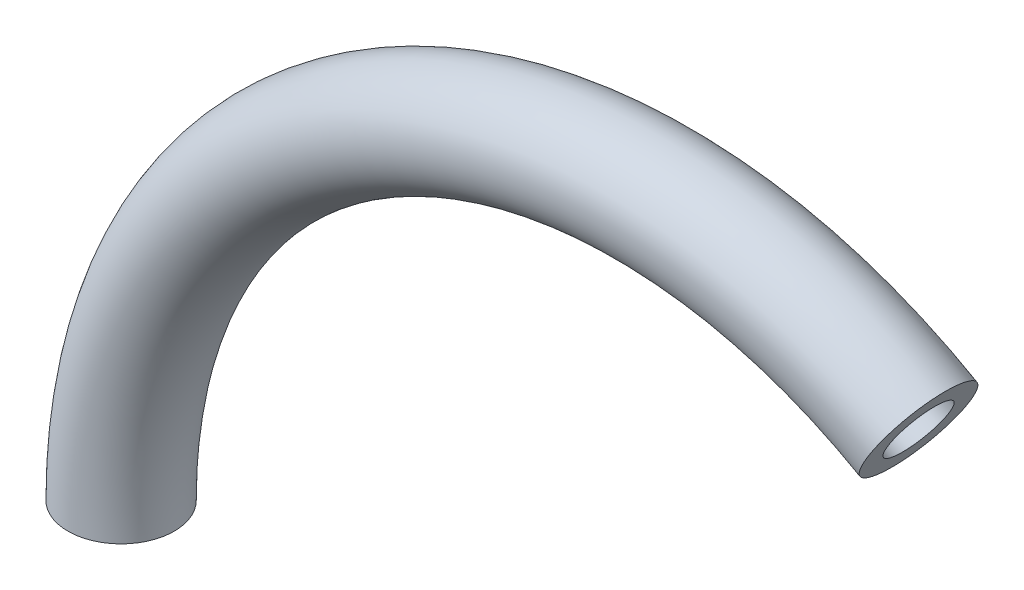
ISO-10303-21;
HEADER;
FILE_DESCRIPTION(('STEP AP214'),'2;1');
FILE_NAME('part.step','',(''),(''),'','','');
FILE_SCHEMA(('AUTOMOTIVE_DESIGN { 1 0 10303 214 1 1 1 1 }'));
ENDSEC;
DATA;
#1=APPLICATION_CONTEXT('core data for automotive mechanical design processes');
#2=APPLICATION_PROTOCOL_DEFINITION('international standard','automotive_design',2000,#1);
#3=PRODUCT_CONTEXT('',#1,'mechanical');
#4=PRODUCT('Part','Part','',(#3));
#5=PRODUCT_RELATED_PRODUCT_CATEGORY('part','',(#4));
#6=PRODUCT_DEFINITION_FORMATION('','',#4);
#7=PRODUCT_DEFINITION_CONTEXT('part definition',#1,'design');
#8=PRODUCT_DEFINITION('design','',#6,#7);
#9=PRODUCT_DEFINITION_SHAPE('','',#8);
#10=(LENGTH_UNIT() NAMED_UNIT(*) SI_UNIT(.MILLI.,.METRE.));
#11=(NAMED_UNIT(*) PLANE_ANGLE_UNIT() SI_UNIT($,.RADIAN.));
#12=(NAMED_UNIT(*) SI_UNIT($,.STERADIAN.) SOLID_ANGLE_UNIT());
#13=UNCERTAINTY_MEASURE_WITH_UNIT(LENGTH_MEASURE(1.E-05),#10,'distance_accuracy_value','');
#14=(GEOMETRIC_REPRESENTATION_CONTEXT(3) GLOBAL_UNCERTAINTY_ASSIGNED_CONTEXT((#13)) GLOBAL_UNIT_ASSIGNED_CONTEXT((#10,
#11,#12)) REPRESENTATION_CONTEXT('',''));
#15=CARTESIAN_POINT('',(0.,0.,0.));
#16=DIRECTION('',(0.,0.,1.));
#17=DIRECTION('',(1.,0.,0.));
#18=AXIS2_PLACEMENT_3D('',#15,#16,#17);
#19=CARTESIAN_POINT('',(-63.5,0.,0.));
#20=DIRECTION('',(0.,1.,0.));
#21=DIRECTION('',(0.,0.,1.));
#22=AXIS2_PLACEMENT_3D('',#19,#20,#21);
#23=PLANE('',#22);
#24=CARTESIAN_POINT('',(-63.5,0.,0.));
#25=DIRECTION('',(0.,1.,0.));
#26=DIRECTION('',(0.,0.,1.));
#27=AXIS2_PLACEMENT_3D('',#24,#25,#26);
#28=CIRCLE('',#27,3.81);
#29=CARTESIAN_POINT('',(-67.31,0.,0.));
#30=VERTEX_POINT('',#29);
#31=EDGE_CURVE('E54',#30,#30,#28,.T.);
#32=ORIENTED_EDGE('',*,*,#31,.T.);
#33=EDGE_LOOP('',(#32));
#34=FACE_BOUND('',#33,.T.);
#35=CARTESIAN_POINT('',(-63.5,0.,0.));
#36=DIRECTION('',(0.,1.,0.));
#37=DIRECTION('',(0.,0.,1.));
#38=AXIS2_PLACEMENT_3D('',#35,#36,#37);
#39=CIRCLE('',#38,6.35);
#40=CARTESIAN_POINT('',(-69.85,0.,0.));
#41=VERTEX_POINT('',#40);
#42=EDGE_CURVE('E44',#41,#41,#39,.T.);
#43=ORIENTED_EDGE('',*,*,#42,.F.);
#44=EDGE_LOOP('',(#43));
#45=FACE_BOUND('',#44,.T.);
#46=ADVANCED_FACE('F37',(#34,#45),#23,.F.);
#47=CARTESIAN_POINT('',(31.7500000000003,54.9926131403117,0.));
#48=DIRECTION('',(0.866025403784436,-0.500000000000004,0.));
#49=DIRECTION('',(0.,0.,1.));
#50=AXIS2_PLACEMENT_3D('',#47,#48,#49);
#51=PLANE('',#50);
#52=CARTESIAN_POINT('',(31.7500000000003,54.9926131403117,0.));
#53=DIRECTION('',(0.866025403784436,-0.500000000000004,0.));
#54=DIRECTION('',(0.500000000000004,0.866025403784436,0.));
#55=AXIS2_PLACEMENT_3D('',#52,#53,#54);
#56=CIRCLE('',#55,3.81);
#57=CARTESIAN_POINT('',(33.6550000000003,58.2921699287304,0.));
#58=VERTEX_POINT('',#57);
#59=EDGE_CURVE('E49',#58,#58,#56,.T.);
#60=ORIENTED_EDGE('',*,*,#59,.F.);
#61=EDGE_LOOP('',(#60));
#62=FACE_BOUND('',#61,.T.);
#63=CARTESIAN_POINT('',(31.7500000000003,54.9926131403117,0.));
#64=DIRECTION('',(0.866025403784436,-0.500000000000004,0.));
#65=DIRECTION('',(0.,0.,1.));
#66=AXIS2_PLACEMENT_3D('',#63,#64,#65);
#67=CIRCLE('',#66,6.35);
#68=CARTESIAN_POINT('',(34.9250000000003,60.4918744543429,0.));
#69=VERTEX_POINT('',#68);
#70=EDGE_CURVE('E10',#69,#69,#67,.T.);
#71=ORIENTED_EDGE('',*,*,#70,.T.);
#72=EDGE_LOOP('',(#71));
#73=FACE_BOUND('',#72,.T.);
#74=ADVANCED_FACE('F71',(#62,#73),#51,.T.);
#75=CARTESIAN_POINT('',(0.,0.,0.));
#76=DIRECTION('',(0.,0.,-1.));
#77=DIRECTION('',(-1.,0.,0.));
#78=AXIS2_PLACEMENT_3D('',#75,#76,#77);
#79=TOROIDAL_SURFACE('',#78,63.5,6.35);
#80=CARTESIAN_POINT('',(0.,0.,0.));
#81=DIRECTION('',(0.,0.,-1.));
#82=DIRECTION('',(-1.,0.,0.));
#83=AXIS2_PLACEMENT_3D('',#80,#81,#82);
#84=CIRCLE('',#83,69.85);
#85=EDGE_CURVE('',#41,#69,#84,.T.);
#86=ORIENTED_EDGE('',*,*,#42,.T.);
#87=ORIENTED_EDGE('',*,*,#70,.F.);
#88=ORIENTED_EDGE('',*,*,#85,.T.);
#89=ORIENTED_EDGE('',*,*,#85,.F.);
#90=EDGE_LOOP('',(#86,#88,#87,#89));
#91=FACE_BOUND('',#90,.T.);
#92=ADVANCED_FACE('F65',(#91),#79,.T.);
#93=CARTESIAN_POINT('',(0.,0.,0.));
#94=DIRECTION('',(0.,0.,-1.));
#95=DIRECTION('',(-1.,0.,0.));
#96=AXIS2_PLACEMENT_3D('',#93,#94,#95);
#97=TOROIDAL_SURFACE('',#96,63.5,3.81);
#98=CARTESIAN_POINT('',(0.,0.,0.));
#99=DIRECTION('',(0.,0.,-1.));
#100=DIRECTION('',(-1.,0.,0.));
#101=AXIS2_PLACEMENT_3D('',#98,#99,#100);
#102=CIRCLE('',#101,67.31);
#103=EDGE_CURVE('',#30,#58,#102,.T.);
#104=ORIENTED_EDGE('',*,*,#31,.F.);
#105=ORIENTED_EDGE('',*,*,#59,.T.);
#106=ORIENTED_EDGE('',*,*,#103,.T.);
#107=ORIENTED_EDGE('',*,*,#103,.F.);
#108=EDGE_LOOP('',(#104,#106,#105,#107));
#109=FACE_BOUND('',#108,.T.);
#110=ADVANCED_FACE('F63',(#109),#97,.F.);
#111=CLOSED_SHELL('',(#46,#74,#92,#110));
#112=MANIFOLD_SOLID_BREP('B2',#111);
#113=ADVANCED_BREP_SHAPE_REPRESENTATION('',(#18,#112),#14);
#114=SHAPE_DEFINITION_REPRESENTATION(#9,#113);
ENDSEC;
END-ISO-10303-21;
